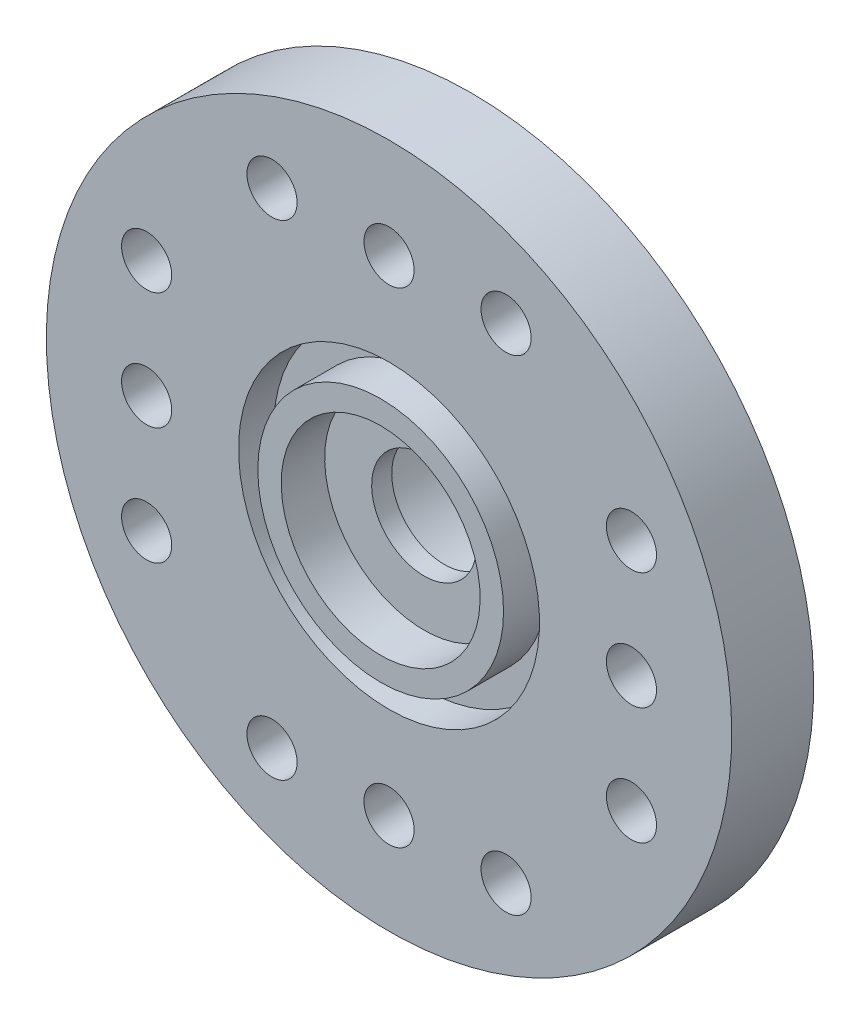
ISO-10303-21;
HEADER;
FILE_DESCRIPTION(('STEP AP214'),'2;1');
FILE_NAME('part.step','',(''),(''),'','','');
FILE_SCHEMA(('AUTOMOTIVE_DESIGN { 1 0 10303 214 1 1 1 1 }'));
ENDSEC;
DATA;
#1=APPLICATION_CONTEXT('core data for automotive mechanical design processes');
#2=APPLICATION_PROTOCOL_DEFINITION('international standard','automotive_design',2000,#1);
#3=PRODUCT_CONTEXT('',#1,'mechanical');
#4=PRODUCT('Part','Part','',(#3));
#5=PRODUCT_RELATED_PRODUCT_CATEGORY('part','',(#4));
#6=PRODUCT_DEFINITION_FORMATION('','',#4);
#7=PRODUCT_DEFINITION_CONTEXT('part definition',#1,'design');
#8=PRODUCT_DEFINITION('design','',#6,#7);
#9=PRODUCT_DEFINITION_SHAPE('','',#8);
#10=(LENGTH_UNIT() NAMED_UNIT(*) SI_UNIT(.MILLI.,.METRE.));
#11=(NAMED_UNIT(*) PLANE_ANGLE_UNIT() SI_UNIT($,.RADIAN.));
#12=(NAMED_UNIT(*) SI_UNIT($,.STERADIAN.) SOLID_ANGLE_UNIT());
#13=UNCERTAINTY_MEASURE_WITH_UNIT(LENGTH_MEASURE(1.E-05),#10,'distance_accuracy_value','');
#14=(GEOMETRIC_REPRESENTATION_CONTEXT(3) GLOBAL_UNCERTAINTY_ASSIGNED_CONTEXT((#13)) GLOBAL_UNIT_ASSIGNED_CONTEXT((#10,
#11,#12)) REPRESENTATION_CONTEXT('',''));
#15=CARTESIAN_POINT('',(0.,0.,0.));
#16=DIRECTION('',(0.,0.,1.));
#17=DIRECTION('',(1.,0.,0.));
#18=AXIS2_PLACEMENT_3D('',#15,#16,#17);
#19=CARTESIAN_POINT('',(2.975,0.,1.3));
#20=DIRECTION('',(0.,0.,1.));
#21=DIRECTION('',(1.,0.,0.));
#22=AXIS2_PLACEMENT_3D('',#19,#20,#21);
#23=PLANE('',#22);
#24=CARTESIAN_POINT('',(0.,0.,1.30000000001));
#25=DIRECTION('',(0.,0.,-1.));
#26=DIRECTION('',(0.,1.,0.));
#27=AXIS2_PLACEMENT_3D('',#24,#25,#26);
#28=CIRCLE('',#27,2.97500000001);
#29=CARTESIAN_POINT('',(0.,2.97500000001,1.30000000001));
#30=VERTEX_POINT('',#29);
#31=EDGE_CURVE('E249',#30,#30,#28,.T.);
#32=ORIENTED_EDGE('',*,*,#31,.T.);
#33=EDGE_LOOP('',(#32));
#34=FACE_BOUND('',#33,.T.);
#35=CARTESIAN_POINT('',(0.,0.,1.30000000001));
#36=DIRECTION('',(0.,0.,-1.));
#37=DIRECTION('',(0.,1.,0.));
#38=AXIS2_PLACEMENT_3D('',#35,#36,#37);
#39=CIRCLE('',#38,3.67500000001);
#40=CARTESIAN_POINT('',(0.,3.67500000001,1.30000000001));
#41=VERTEX_POINT('',#40);
#42=EDGE_CURVE('E248',#41,#41,#39,.T.);
#43=ORIENTED_EDGE('',*,*,#42,.F.);
#44=EDGE_LOOP('',(#43));
#45=FACE_BOUND('',#44,.T.);
#46=ADVANCED_FACE('F16',(#34,#45),#23,.T.);
#47=CARTESIAN_POINT('',(3.675,0.,0.));
#48=DIRECTION('',(0.,0.,1.));
#49=DIRECTION('',(1.,0.,0.));
#50=AXIS2_PLACEMENT_3D('',#47,#48,#49);
#51=PLANE('',#50);
#52=CARTESIAN_POINT('',(0.,0.,0.));
#53=DIRECTION('',(0.,0.,-1.));
#54=DIRECTION('',(0.,1.,0.));
#55=AXIS2_PLACEMENT_3D('',#52,#53,#54);
#56=CIRCLE('',#55,3.67500000001);
#57=CARTESIAN_POINT('',(0.,3.67500000001,0.));
#58=VERTEX_POINT('',#57);
#59=EDGE_CURVE('E245',#58,#58,#56,.T.);
#60=ORIENTED_EDGE('',*,*,#59,.T.);
#61=EDGE_LOOP('',(#60));
#62=FACE_BOUND('',#61,.T.);
#63=CARTESIAN_POINT('',(0.,0.,0.));
#64=DIRECTION('',(0.,0.,-1.));
#65=DIRECTION('',(0.,1.,0.));
#66=AXIS2_PLACEMENT_3D('',#63,#64,#65);
#67=CIRCLE('',#66,4.50000000001);
#68=CARTESIAN_POINT('',(0.,4.50000000001,0.));
#69=VERTEX_POINT('',#68);
#70=EDGE_CURVE('E262',#69,#69,#67,.T.);
#71=ORIENTED_EDGE('',*,*,#70,.F.);
#72=EDGE_LOOP('',(#71));
#73=FACE_BOUND('',#72,.T.);
#74=ADVANCED_FACE('F356',(#62,#73),#51,.T.);
#75=CARTESIAN_POINT('',(2.85,0.,-4.4));
#76=DIRECTION('',(0.,0.,-1.));
#77=DIRECTION('',(0.,-1.,0.));
#78=AXIS2_PLACEMENT_3D('',#75,#76,#77);
#79=PLANE('',#78);
#80=CARTESIAN_POINT('',(0.,0.,-4.40000000001));
#81=DIRECTION('',(0.,0.,-1.));
#82=DIRECTION('',(0.,1.,0.));
#83=AXIS2_PLACEMENT_3D('',#80,#81,#82);
#84=CIRCLE('',#83,2.85000000001);
#85=CARTESIAN_POINT('',(0.,2.85000000001,-4.40000000001));
#86=VERTEX_POINT('',#85);
#87=EDGE_CURVE('E238',#86,#86,#84,.T.);
#88=ORIENTED_EDGE('',*,*,#87,.F.);
#89=EDGE_LOOP('',(#88));
#90=FACE_BOUND('',#89,.T.);
#91=CARTESIAN_POINT('',(0.,0.,-4.40000000001));
#92=DIRECTION('',(0.,0.,-1.));
#93=DIRECTION('',(0.,1.,0.));
#94=AXIS2_PLACEMENT_3D('',#91,#92,#93);
#95=CIRCLE('',#94,4.20000000001);
#96=CARTESIAN_POINT('',(0.,4.20000000001,-4.40000000001));
#97=VERTEX_POINT('',#96);
#98=EDGE_CURVE('E213',#97,#97,#95,.T.);
#99=ORIENTED_EDGE('',*,*,#98,.T.);
#100=EDGE_LOOP('',(#99));
#101=FACE_BOUND('',#100,.T.);
#102=ADVANCED_FACE('F362',(#90,#101),#79,.T.);
#103=CARTESIAN_POINT('',(1.57,0.,-0.6));
#104=DIRECTION('',(0.,0.,-1.));
#105=DIRECTION('',(0.,-1.,0.));
#106=AXIS2_PLACEMENT_3D('',#103,#104,#105);
#107=PLANE('',#106);
#108=CARTESIAN_POINT('',(0.,0.,-0.60000000001));
#109=DIRECTION('',(0.,0.,-1.));
#110=DIRECTION('',(0.,1.,0.));
#111=AXIS2_PLACEMENT_3D('',#108,#109,#110);
#112=CIRCLE('',#111,1.57000000001);
#113=CARTESIAN_POINT('',(0.,1.57000000001,-0.60000000001));
#114=VERTEX_POINT('',#113);
#115=EDGE_CURVE('E27',#114,#114,#112,.T.);
#116=ORIENTED_EDGE('',*,*,#115,.F.);
#117=EDGE_LOOP('',(#116));
#118=FACE_BOUND('',#117,.T.);
#119=CARTESIAN_POINT('',(0.,0.,-0.60000000001));
#120=DIRECTION('',(0.,0.,-1.));
#121=DIRECTION('',(0.,1.,0.));
#122=AXIS2_PLACEMENT_3D('',#119,#120,#121);
#123=CIRCLE('',#122,2.85000000001);
#124=CARTESIAN_POINT('',(0.,2.85000000001,-0.60000000001));
#125=VERTEX_POINT('',#124);
#126=EDGE_CURVE('E234',#125,#125,#123,.T.);
#127=ORIENTED_EDGE('',*,*,#126,.T.);
#128=EDGE_LOOP('',(#127));
#129=FACE_BOUND('',#128,.T.);
#130=ADVANCED_FACE('F386',(#118,#129),#107,.T.);
#131=CARTESIAN_POINT('',(1.57,0.,0.));
#132=DIRECTION('',(0.,0.,1.));
#133=DIRECTION('',(1.,0.,0.));
#134=AXIS2_PLACEMENT_3D('',#131,#132,#133);
#135=PLANE('',#134);
#136=CARTESIAN_POINT('',(0.,0.,0.));
#137=DIRECTION('',(0.,0.,-1.));
#138=DIRECTION('',(0.,1.,0.));
#139=AXIS2_PLACEMENT_3D('',#136,#137,#138);
#140=CIRCLE('',#139,1.57000000001);
#141=CARTESIAN_POINT('',(0.,1.57000000001,0.));
#142=VERTEX_POINT('',#141);
#143=EDGE_CURVE('E11',#142,#142,#140,.T.);
#144=ORIENTED_EDGE('',*,*,#143,.T.);
#145=EDGE_LOOP('',(#144));
#146=FACE_BOUND('',#145,.T.);
#147=CARTESIAN_POINT('',(0.,0.,0.));
#148=DIRECTION('',(0.,0.,-1.));
#149=DIRECTION('',(0.,1.,0.));
#150=AXIS2_PLACEMENT_3D('',#147,#148,#149);
#151=CIRCLE('',#150,2.97500000001);
#152=CARTESIAN_POINT('',(0.,2.97500000001,0.));
#153=VERTEX_POINT('',#152);
#154=EDGE_CURVE('E297',#153,#153,#151,.T.);
#155=ORIENTED_EDGE('',*,*,#154,.F.);
#156=EDGE_LOOP('',(#155));
#157=FACE_BOUND('',#156,.T.);
#158=ADVANCED_FACE('F383',(#146,#157),#135,.T.);
#159=CARTESIAN_POINT('',(10.25,0.,1.05));
#160=DIRECTION('',(0.,0.,1.));
#161=DIRECTION('',(1.,0.,0.));
#162=AXIS2_PLACEMENT_3D('',#159,#160,#161);
#163=PLANE('',#162);
#164=CARTESIAN_POINT('',(-3.50000000000992,7.25000000001004,1.05000000001));
#165=DIRECTION('',(0.,0.,-1.));
#166=DIRECTION('',(-1.,1.33437416740113E-11,0.));
#167=AXIS2_PLACEMENT_3D('',#164,#165,#166);
#168=CIRCLE('',#167,0.75000000001);
#169=CARTESIAN_POINT('',(-4.25000000001993,7.25000000002005,1.05000000001));
#170=VERTEX_POINT('',#169);
#171=EDGE_CURVE('E222',#170,#170,#168,.T.);
#172=ORIENTED_EDGE('',*,*,#171,.T.);
#173=EDGE_LOOP('',(#172));
#174=FACE_BOUND('',#173,.T.);
#175=CARTESIAN_POINT('',(3.50000000000998,-7.25000000001001,1.05000000001));
#176=DIRECTION('',(0.,0.,-1.));
#177=DIRECTION('',(1.,-1.33368027801075E-11,0.));
#178=AXIS2_PLACEMENT_3D('',#175,#176,#177);
#179=CIRCLE('',#178,0.750000000009999);
#180=CARTESIAN_POINT('',(4.25000000001997,-7.25000000002001,1.05000000001));
#181=VERTEX_POINT('',#180);
#182=EDGE_CURVE('E199',#181,#181,#179,.T.);
#183=ORIENTED_EDGE('',*,*,#182,.T.);
#184=EDGE_LOOP('',(#183));
#185=FACE_BOUND('',#184,.T.);
#186=CARTESIAN_POINT('',(1.00759397191198E-11,7.25000000001,1.05000000001));
#187=DIRECTION('',(0.,0.,1.));
#188=DIRECTION('',(1.,-1.33437416740113E-11,0.));
#189=AXIS2_PLACEMENT_3D('',#186,#187,#188);
#190=CIRCLE('',#189,0.750000000009999);
#191=CARTESIAN_POINT('',(0.750000000020075,7.25,1.05000000001));
#192=VERTEX_POINT('',#191);
#193=EDGE_CURVE('E198',#192,#192,#190,.T.);
#194=ORIENTED_EDGE('',*,*,#193,.F.);
#195=EDGE_LOOP('',(#194));
#196=FACE_BOUND('',#195,.T.);
#197=CARTESIAN_POINT('',(-7.25000000001,0.,1.05000000001));
#198=DIRECTION('',(0.,0.,1.));
#199=DIRECTION('',(0.,1.,0.));
#200=AXIS2_PLACEMENT_3D('',#197,#198,#199);
#201=CIRCLE('',#200,0.750000000009999);
#202=CARTESIAN_POINT('',(-7.25000000001,0.750000000009999,1.05000000001));
#203=VERTEX_POINT('',#202);
#204=EDGE_CURVE('E231',#203,#203,#201,.T.);
#205=ORIENTED_EDGE('',*,*,#204,.F.);
#206=EDGE_LOOP('',(#205));
#207=FACE_BOUND('',#206,.T.);
#208=CARTESIAN_POINT('',(-1.00253132397066E-11,-7.25000000001,1.05000000001));
#209=DIRECTION('',(0.,0.,1.));
#210=DIRECTION('',(-1.,1.33368027801075E-11,0.));
#211=AXIS2_PLACEMENT_3D('',#208,#209,#210);
#212=CIRCLE('',#211,0.750000000009999);
#213=CARTESIAN_POINT('',(-0.750000000020024,-7.25,1.05000000001));
#214=VERTEX_POINT('',#213);
#215=EDGE_CURVE('E273',#214,#214,#212,.T.);
#216=ORIENTED_EDGE('',*,*,#215,.F.);
#217=EDGE_LOOP('',(#216));
#218=FACE_BOUND('',#217,.T.);
#219=CARTESIAN_POINT('',(0.,0.,1.05000000001));
#220=DIRECTION('',(0.,0.,-1.));
#221=DIRECTION('',(0.,1.,0.));
#222=AXIS2_PLACEMENT_3D('',#219,#220,#221);
#223=CIRCLE('',#222,4.50000000001);
#224=CARTESIAN_POINT('',(0.,4.50000000001,1.05000000001));
#225=VERTEX_POINT('',#224);
#226=EDGE_CURVE('E258',#225,#225,#223,.T.);
#227=ORIENTED_EDGE('',*,*,#226,.T.);
#228=EDGE_LOOP('',(#227));
#229=FACE_BOUND('',#228,.T.);
#230=CARTESIAN_POINT('',(7.25000000001,0.,1.05000000001));
#231=DIRECTION('',(0.,0.,1.));
#232=DIRECTION('',(0.,-1.,0.));
#233=AXIS2_PLACEMENT_3D('',#230,#231,#232);
#234=CIRCLE('',#233,0.750000000009999);
#235=CARTESIAN_POINT('',(7.25000000001,-0.750000000009999,1.05000000001));
#236=VERTEX_POINT('',#235);
#237=EDGE_CURVE('E241',#236,#236,#234,.T.);
#238=ORIENTED_EDGE('',*,*,#237,.F.);
#239=EDGE_LOOP('',(#238));
#240=FACE_BOUND('',#239,.T.);
#241=CARTESIAN_POINT('',(7.25000000001,-3.50000000001,1.05000000001));
#242=DIRECTION('',(0.,0.,1.));
#243=DIRECTION('',(0.,-1.,0.));
#244=AXIS2_PLACEMENT_3D('',#241,#242,#243);
#245=CIRCLE('',#244,0.750000000009999);
#246=CARTESIAN_POINT('',(7.25000000001,-4.25000000002,1.05000000001));
#247=VERTEX_POINT('',#246);
#248=EDGE_CURVE('E268',#247,#247,#245,.T.);
#249=ORIENTED_EDGE('',*,*,#248,.F.);
#250=EDGE_LOOP('',(#249));
#251=FACE_BOUND('',#250,.T.);
#252=CARTESIAN_POINT('',(7.25000000001,3.50000000001,1.05000000001));
#253=DIRECTION('',(0.,0.,-1.));
#254=DIRECTION('',(0.,1.,0.));
#255=AXIS2_PLACEMENT_3D('',#252,#253,#254);
#256=CIRCLE('',#255,0.750000000009999);
#257=CARTESIAN_POINT('',(7.25000000001,4.25000000002,1.05000000001));
#258=VERTEX_POINT('',#257);
#259=EDGE_CURVE('E250',#258,#258,#256,.T.);
#260=ORIENTED_EDGE('',*,*,#259,.T.);
#261=EDGE_LOOP('',(#260));
#262=FACE_BOUND('',#261,.T.);
#263=CARTESIAN_POINT('',(-7.25000000001,-3.50000000001,1.05000000001));
#264=DIRECTION('',(0.,0.,-1.));
#265=DIRECTION('',(0.,-1.,0.));
#266=AXIS2_PLACEMENT_3D('',#263,#264,#265);
#267=CIRCLE('',#266,0.750000000009999);
#268=CARTESIAN_POINT('',(-7.25000000001,-4.25000000002,1.05000000001));
#269=VERTEX_POINT('',#268);
#270=EDGE_CURVE('E89',#269,#269,#267,.T.);
#271=ORIENTED_EDGE('',*,*,#270,.T.);
#272=EDGE_LOOP('',(#271));
#273=FACE_BOUND('',#272,.T.);
#274=CARTESIAN_POINT('',(-3.50000000001003,-7.25000000000999,1.05000000001));
#275=DIRECTION('',(0.,0.,1.));
#276=DIRECTION('',(-1.,1.33368027801075E-11,0.));
#277=AXIS2_PLACEMENT_3D('',#274,#275,#276);
#278=CIRCLE('',#277,0.750000000009999);
#279=CARTESIAN_POINT('',(-4.25000000002002,-7.25,1.05000000001));
#280=VERTEX_POINT('',#279);
#281=EDGE_CURVE('E223',#280,#280,#278,.T.);
#282=ORIENTED_EDGE('',*,*,#281,.F.);
#283=EDGE_LOOP('',(#282));
#284=FACE_BOUND('',#283,.T.);
#285=CARTESIAN_POINT('',(-7.25000000001,3.50000000001,1.05000000001));
#286=DIRECTION('',(0.,0.,1.));
#287=DIRECTION('',(0.,1.,0.));
#288=AXIS2_PLACEMENT_3D('',#285,#286,#287);
#289=CIRCLE('',#288,0.750000000009999);
#290=CARTESIAN_POINT('',(-7.25000000001,4.25000000002,1.05000000001));
#291=VERTEX_POINT('',#290);
#292=EDGE_CURVE('E128',#291,#291,#289,.T.);
#293=ORIENTED_EDGE('',*,*,#292,.F.);
#294=EDGE_LOOP('',(#293));
#295=FACE_BOUND('',#294,.T.);
#296=CARTESIAN_POINT('',(3.50000000001007,7.25000000000996,1.05000000001));
#297=DIRECTION('',(0.,0.,1.));
#298=DIRECTION('',(1.,-1.33437416740113E-11,0.));
#299=AXIS2_PLACEMENT_3D('',#296,#297,#298);
#300=CIRCLE('',#299,0.750000000009999);
#301=CARTESIAN_POINT('',(4.25000000002007,7.25,1.05000000001));
#302=VERTEX_POINT('',#301);
#303=EDGE_CURVE('E271',#302,#302,#300,.T.);
#304=ORIENTED_EDGE('',*,*,#303,.F.);
#305=EDGE_LOOP('',(#304));
#306=FACE_BOUND('',#305,.T.);
#307=CARTESIAN_POINT('',(0.,0.,1.05000000001));
#308=DIRECTION('',(0.,0.,-1.));
#309=DIRECTION('',(0.,1.,0.));
#310=AXIS2_PLACEMENT_3D('',#307,#308,#309);
#311=CIRCLE('',#310,10.25000000001);
#312=CARTESIAN_POINT('',(0.,10.25000000001,1.05000000001));
#313=VERTEX_POINT('',#312);
#314=EDGE_CURVE('E218',#313,#313,#311,.T.);
#315=ORIENTED_EDGE('',*,*,#314,.F.);
#316=EDGE_LOOP('',(#315));
#317=FACE_BOUND('',#316,.T.);
#318=ADVANCED_FACE('F321',(#174,#185,#196,#207,#218,#229,#240,#251,#262,#273,#284,#295,#306,
#317),#163,.T.);
#319=CARTESIAN_POINT('',(4.2,0.,-1.4));
#320=DIRECTION('',(0.,0.,-1.));
#321=DIRECTION('',(0.,-1.,0.));
#322=AXIS2_PLACEMENT_3D('',#319,#320,#321);
#323=PLANE('',#322);
#324=CARTESIAN_POINT('',(-3.50000000000992,7.25000000001004,-1.40000000001));
#325=DIRECTION('',(0.,0.,1.));
#326=DIRECTION('',(0.,1.,0.));
#327=AXIS2_PLACEMENT_3D('',#324,#325,#326);
#328=CIRCLE('',#327,0.75000000001);
#329=CARTESIAN_POINT('',(-3.50000000000992,8.00000000002004,-1.40000000001));
#330=VERTEX_POINT('',#329);
#331=EDGE_CURVE('E228',#330,#330,#328,.T.);
#332=ORIENTED_EDGE('',*,*,#331,.T.);
#333=EDGE_LOOP('',(#332));
#334=FACE_BOUND('',#333,.T.);
#335=CARTESIAN_POINT('',(3.50000000000998,-7.25000000001001,-1.40000000001));
#336=DIRECTION('',(0.,0.,1.));
#337=DIRECTION('',(0.,1.,0.));
#338=AXIS2_PLACEMENT_3D('',#335,#336,#337);
#339=CIRCLE('',#338,0.75000000001);
#340=CARTESIAN_POINT('',(3.50000000000998,-6.5,-1.40000000001));
#341=VERTEX_POINT('',#340);
#342=EDGE_CURVE('E193',#341,#341,#339,.T.);
#343=ORIENTED_EDGE('',*,*,#342,.T.);
#344=EDGE_LOOP('',(#343));
#345=FACE_BOUND('',#344,.T.);
#346=CARTESIAN_POINT('',(1.00759397191198E-11,7.25000000001,-1.40000000001));
#347=DIRECTION('',(0.,0.,-1.));
#348=DIRECTION('',(0.,1.,0.));
#349=AXIS2_PLACEMENT_3D('',#346,#347,#348);
#350=CIRCLE('',#349,0.75000000001);
#351=CARTESIAN_POINT('',(1.00759397191198E-11,8.00000000002,-1.40000000001));
#352=VERTEX_POINT('',#351);
#353=EDGE_CURVE('E206',#352,#352,#350,.T.);
#354=ORIENTED_EDGE('',*,*,#353,.F.);
#355=EDGE_LOOP('',(#354));
#356=FACE_BOUND('',#355,.T.);
#357=CARTESIAN_POINT('',(-7.25000000001,0.,-1.40000000001));
#358=DIRECTION('',(0.,0.,-1.));
#359=DIRECTION('',(0.,1.,0.));
#360=AXIS2_PLACEMENT_3D('',#357,#358,#359);
#361=CIRCLE('',#360,0.750000000009999);
#362=CARTESIAN_POINT('',(-7.25000000001,0.750000000009999,-1.40000000001));
#363=VERTEX_POINT('',#362);
#364=EDGE_CURVE('E261',#363,#363,#361,.T.);
#365=ORIENTED_EDGE('',*,*,#364,.F.);
#366=EDGE_LOOP('',(#365));
#367=FACE_BOUND('',#366,.T.);
#368=CARTESIAN_POINT('',(-1.00253132397066E-11,-7.25000000001,-1.40000000001));
#369=DIRECTION('',(0.,0.,-1.));
#370=DIRECTION('',(0.,1.,0.));
#371=AXIS2_PLACEMENT_3D('',#368,#369,#370);
#372=CIRCLE('',#371,0.75000000001);
#373=CARTESIAN_POINT('',(-1.00253132397066E-11,-6.5,-1.40000000001));
#374=VERTEX_POINT('',#373);
#375=EDGE_CURVE('E254',#374,#374,#372,.T.);
#376=ORIENTED_EDGE('',*,*,#375,.F.);
#377=EDGE_LOOP('',(#376));
#378=FACE_BOUND('',#377,.T.);
#379=CARTESIAN_POINT('',(0.,0.,-1.40000000001));
#380=DIRECTION('',(0.,0.,-1.));
#381=DIRECTION('',(0.,1.,0.));
#382=AXIS2_PLACEMENT_3D('',#379,#380,#381);
#383=CIRCLE('',#382,4.20000000001);
#384=CARTESIAN_POINT('',(0.,4.20000000001,-1.40000000001));
#385=VERTEX_POINT('',#384);
#386=EDGE_CURVE('E217',#385,#385,#383,.T.);
#387=ORIENTED_EDGE('',*,*,#386,.F.);
#388=EDGE_LOOP('',(#387));
#389=FACE_BOUND('',#388,.T.);
#390=CARTESIAN_POINT('',(7.25000000001,0.,-1.40000000001));
#391=DIRECTION('',(0.,0.,-1.));
#392=DIRECTION('',(0.,1.,0.));
#393=AXIS2_PLACEMENT_3D('',#390,#391,#392);
#394=CIRCLE('',#393,0.750000000009999);
#395=CARTESIAN_POINT('',(7.25000000001,0.750000000009999,-1.40000000001));
#396=VERTEX_POINT('',#395);
#397=EDGE_CURVE('E244',#396,#396,#394,.T.);
#398=ORIENTED_EDGE('',*,*,#397,.F.);
#399=EDGE_LOOP('',(#398));
#400=FACE_BOUND('',#399,.T.);
#401=CARTESIAN_POINT('',(7.25000000001,-3.50000000001,-1.40000000001));
#402=DIRECTION('',(0.,0.,-1.));
#403=DIRECTION('',(0.,1.,0.));
#404=AXIS2_PLACEMENT_3D('',#401,#402,#403);
#405=CIRCLE('',#404,0.750000000009999);
#406=CARTESIAN_POINT('',(7.25000000001,-2.75,-1.40000000001));
#407=VERTEX_POINT('',#406);
#408=EDGE_CURVE('E211',#407,#407,#405,.T.);
#409=ORIENTED_EDGE('',*,*,#408,.F.);
#410=EDGE_LOOP('',(#409));
#411=FACE_BOUND('',#410,.T.);
#412=CARTESIAN_POINT('',(7.25000000001,3.50000000001,-1.40000000001));
#413=DIRECTION('',(0.,0.,1.));
#414=DIRECTION('',(0.,1.,0.));
#415=AXIS2_PLACEMENT_3D('',#412,#413,#414);
#416=CIRCLE('',#415,0.750000000009999);
#417=CARTESIAN_POINT('',(7.25000000001,4.25000000002,-1.40000000001));
#418=VERTEX_POINT('',#417);
#419=EDGE_CURVE('E253',#418,#418,#416,.T.);
#420=ORIENTED_EDGE('',*,*,#419,.T.);
#421=EDGE_LOOP('',(#420));
#422=FACE_BOUND('',#421,.T.);
#423=CARTESIAN_POINT('',(-7.25000000001,-3.50000000001,-1.40000000001));
#424=DIRECTION('',(0.,0.,1.));
#425=DIRECTION('',(0.,1.,0.));
#426=AXIS2_PLACEMENT_3D('',#423,#424,#425);
#427=CIRCLE('',#426,0.750000000009999);
#428=CARTESIAN_POINT('',(-7.25000000001,-2.75,-1.40000000001));
#429=VERTEX_POINT('',#428);
#430=EDGE_CURVE('E75',#429,#429,#427,.T.);
#431=ORIENTED_EDGE('',*,*,#430,.T.);
#432=EDGE_LOOP('',(#431));
#433=FACE_BOUND('',#432,.T.);
#434=CARTESIAN_POINT('',(-3.50000000001003,-7.25000000000999,-1.40000000001));
#435=DIRECTION('',(0.,0.,-1.));
#436=DIRECTION('',(0.,1.,0.));
#437=AXIS2_PLACEMENT_3D('',#434,#435,#436);
#438=CIRCLE('',#437,0.75000000001);
#439=CARTESIAN_POINT('',(-3.50000000001003,-6.5,-1.40000000001));
#440=VERTEX_POINT('',#439);
#441=EDGE_CURVE('E219',#440,#440,#438,.T.);
#442=ORIENTED_EDGE('',*,*,#441,.F.);
#443=EDGE_LOOP('',(#442));
#444=FACE_BOUND('',#443,.T.);
#445=CARTESIAN_POINT('',(-7.25000000001,3.50000000001,-1.40000000001));
#446=DIRECTION('',(0.,0.,-1.));
#447=DIRECTION('',(0.,1.,0.));
#448=AXIS2_PLACEMENT_3D('',#445,#446,#447);
#449=CIRCLE('',#448,0.750000000009999);
#450=CARTESIAN_POINT('',(-7.25000000001,4.25000000002,-1.40000000001));
#451=VERTEX_POINT('',#450);
#452=EDGE_CURVE('E116',#451,#451,#449,.T.);
#453=ORIENTED_EDGE('',*,*,#452,.F.);
#454=EDGE_LOOP('',(#453));
#455=FACE_BOUND('',#454,.T.);
#456=CARTESIAN_POINT('',(3.50000000001007,7.25000000000996,-1.40000000001));
#457=DIRECTION('',(0.,0.,-1.));
#458=DIRECTION('',(0.,1.,0.));
#459=AXIS2_PLACEMENT_3D('',#456,#457,#458);
#460=CIRCLE('',#459,0.75000000001);
#461=CARTESIAN_POINT('',(3.50000000001007,8.00000000001996,-1.40000000001));
#462=VERTEX_POINT('',#461);
#463=EDGE_CURVE('E20',#462,#462,#460,.T.);
#464=ORIENTED_EDGE('',*,*,#463,.F.);
#465=EDGE_LOOP('',(#464));
#466=FACE_BOUND('',#465,.T.);
#467=CARTESIAN_POINT('',(0.,0.,-1.40000000001));
#468=DIRECTION('',(0.,0.,-1.));
#469=DIRECTION('',(0.,1.,0.));
#470=AXIS2_PLACEMENT_3D('',#467,#468,#469);
#471=CIRCLE('',#470,10.25000000001);
#472=CARTESIAN_POINT('',(0.,10.25000000001,-1.40000000001));
#473=VERTEX_POINT('',#472);
#474=EDGE_CURVE('E255',#473,#473,#471,.T.);
#475=ORIENTED_EDGE('',*,*,#474,.T.);
#476=EDGE_LOOP('',(#475));
#477=FACE_BOUND('',#476,.T.);
#478=ADVANCED_FACE('F194',(#334,#345,#356,#367,#378,#389,#400,#411,#422,#433,#444,#455,#466,
#477),#323,.T.);
#479=CARTESIAN_POINT('',(0.,0.,0.));
#480=DIRECTION('',(0.,0.,-1.));
#481=DIRECTION('',(0.,1.,0.));
#482=AXIS2_PLACEMENT_3D('',#479,#480,#481);
#483=CYLINDRICAL_SURFACE('',#482,1.57);
#484=ORIENTED_EDGE('',*,*,#143,.F.);
#485=EDGE_LOOP('',(#484));
#486=FACE_BOUND('',#485,.T.);
#487=ORIENTED_EDGE('',*,*,#115,.T.);
#488=EDGE_LOOP('',(#487));
#489=FACE_BOUND('',#488,.T.);
#490=ADVANCED_FACE('F320',(#486,#489),#483,.F.);
#491=CARTESIAN_POINT('',(0.,0.,0.));
#492=DIRECTION('',(0.,0.,-1.));
#493=DIRECTION('',(0.,1.,0.));
#494=AXIS2_PLACEMENT_3D('',#491,#492,#493);
#495=CYLINDRICAL_SURFACE('',#494,2.85);
#496=ORIENTED_EDGE('',*,*,#126,.F.);
#497=EDGE_LOOP('',(#496));
#498=FACE_BOUND('',#497,.T.);
#499=ORIENTED_EDGE('',*,*,#87,.T.);
#500=EDGE_LOOP('',(#499));
#501=FACE_BOUND('',#500,.T.);
#502=ADVANCED_FACE('F349',(#498,#501),#495,.F.);
#503=CARTESIAN_POINT('',(0.,0.,0.));
#504=DIRECTION('',(0.,0.,-1.));
#505=DIRECTION('',(0.,1.,0.));
#506=AXIS2_PLACEMENT_3D('',#503,#504,#505);
#507=CYLINDRICAL_SURFACE('',#506,4.2);
#508=ORIENTED_EDGE('',*,*,#386,.T.);
#509=EDGE_LOOP('',(#508));
#510=FACE_BOUND('',#509,.T.);
#511=ORIENTED_EDGE('',*,*,#98,.F.);
#512=EDGE_LOOP('',(#511));
#513=FACE_BOUND('',#512,.T.);
#514=ADVANCED_FACE('F338',(#510,#513),#507,.T.);
#515=CARTESIAN_POINT('',(0.,0.,0.));
#516=DIRECTION('',(0.,0.,-1.));
#517=DIRECTION('',(0.,1.,0.));
#518=AXIS2_PLACEMENT_3D('',#515,#516,#517);
#519=CYLINDRICAL_SURFACE('',#518,10.25);
#520=ORIENTED_EDGE('',*,*,#314,.T.);
#521=EDGE_LOOP('',(#520));
#522=FACE_BOUND('',#521,.T.);
#523=ORIENTED_EDGE('',*,*,#474,.F.);
#524=EDGE_LOOP('',(#523));
#525=FACE_BOUND('',#524,.T.);
#526=ADVANCED_FACE('F335',(#522,#525),#519,.T.);
#527=CARTESIAN_POINT('',(0.,0.,0.));
#528=DIRECTION('',(0.,0.,-1.));
#529=DIRECTION('',(0.,1.,0.));
#530=AXIS2_PLACEMENT_3D('',#527,#528,#529);
#531=CYLINDRICAL_SURFACE('',#530,4.5);
#532=ORIENTED_EDGE('',*,*,#226,.F.);
#533=EDGE_LOOP('',(#532));
#534=FACE_BOUND('',#533,.T.);
#535=ORIENTED_EDGE('',*,*,#70,.T.);
#536=EDGE_LOOP('',(#535));
#537=FACE_BOUND('',#536,.T.);
#538=ADVANCED_FACE('F337',(#534,#537),#531,.F.);
#539=CARTESIAN_POINT('',(0.,0.,0.));
#540=DIRECTION('',(0.,0.,-1.));
#541=DIRECTION('',(0.,1.,0.));
#542=AXIS2_PLACEMENT_3D('',#539,#540,#541);
#543=CYLINDRICAL_SURFACE('',#542,3.675);
#544=ORIENTED_EDGE('',*,*,#42,.T.);
#545=EDGE_LOOP('',(#544));
#546=FACE_BOUND('',#545,.T.);
#547=ORIENTED_EDGE('',*,*,#59,.F.);
#548=EDGE_LOOP('',(#547));
#549=FACE_BOUND('',#548,.T.);
#550=ADVANCED_FACE('F346',(#546,#549),#543,.T.);
#551=CARTESIAN_POINT('',(0.,0.,0.));
#552=DIRECTION('',(0.,0.,-1.));
#553=DIRECTION('',(0.,1.,0.));
#554=AXIS2_PLACEMENT_3D('',#551,#552,#553);
#555=CYLINDRICAL_SURFACE('',#554,2.975);
#556=ORIENTED_EDGE('',*,*,#31,.F.);
#557=EDGE_LOOP('',(#556));
#558=FACE_BOUND('',#557,.T.);
#559=ORIENTED_EDGE('',*,*,#154,.T.);
#560=EDGE_LOOP('',(#559));
#561=FACE_BOUND('',#560,.T.);
#562=ADVANCED_FACE('F382',(#558,#561),#555,.F.);
#563=CARTESIAN_POINT('',(7.25,0.,-4.4));
#564=DIRECTION('',(0.,0.,1.));
#565=DIRECTION('',(0.,-1.,0.));
#566=AXIS2_PLACEMENT_3D('',#563,#564,#565);
#567=CYLINDRICAL_SURFACE('',#566,0.75);
#568=ORIENTED_EDGE('',*,*,#397,.T.);
#569=EDGE_LOOP('',(#568));
#570=FACE_BOUND('',#569,.T.);
#571=ORIENTED_EDGE('',*,*,#237,.T.);
#572=EDGE_LOOP('',(#571));
#573=FACE_BOUND('',#572,.T.);
#574=ADVANCED_FACE('F315',(#570,#573),#567,.F.);
#575=CARTESIAN_POINT('',(7.25,-3.5,-4.4));
#576=DIRECTION('',(0.,0.,1.));
#577=DIRECTION('',(0.,-1.,0.));
#578=AXIS2_PLACEMENT_3D('',#575,#576,#577);
#579=CYLINDRICAL_SURFACE('',#578,0.75);
#580=ORIENTED_EDGE('',*,*,#408,.T.);
#581=EDGE_LOOP('',(#580));
#582=FACE_BOUND('',#581,.T.);
#583=ORIENTED_EDGE('',*,*,#248,.T.);
#584=EDGE_LOOP('',(#583));
#585=FACE_BOUND('',#584,.T.);
#586=ADVANCED_FACE('F381',(#582,#585),#579,.F.);
#587=CARTESIAN_POINT('',(7.25,3.5,-4.4));
#588=DIRECTION('',(0.,0.,1.));
#589=DIRECTION('',(0.,-1.,0.));
#590=AXIS2_PLACEMENT_3D('',#587,#588,#589);
#591=CYLINDRICAL_SURFACE('',#590,0.75);
#592=ORIENTED_EDGE('',*,*,#419,.F.);
#593=EDGE_LOOP('',(#592));
#594=FACE_BOUND('',#593,.T.);
#595=ORIENTED_EDGE('',*,*,#259,.F.);
#596=EDGE_LOOP('',(#595));
#597=FACE_BOUND('',#596,.T.);
#598=ADVANCED_FACE('F367',(#594,#597),#591,.F.);
#599=CARTESIAN_POINT('',(0.,-7.25,-4.4));
#600=DIRECTION('',(0.,0.,1.));
#601=DIRECTION('',(0.,-1.,0.));
#602=AXIS2_PLACEMENT_3D('',#599,#600,#601);
#603=CYLINDRICAL_SURFACE('',#602,0.75);
#604=ORIENTED_EDGE('',*,*,#375,.T.);
#605=EDGE_LOOP('',(#604));
#606=FACE_BOUND('',#605,.T.);
#607=ORIENTED_EDGE('',*,*,#215,.T.);
#608=EDGE_LOOP('',(#607));
#609=FACE_BOUND('',#608,.T.);
#610=ADVANCED_FACE('F377',(#606,#609),#603,.F.);
#611=CARTESIAN_POINT('',(-7.25,0.,-4.4));
#612=DIRECTION('',(0.,0.,1.));
#613=DIRECTION('',(0.,-1.,0.));
#614=AXIS2_PLACEMENT_3D('',#611,#612,#613);
#615=CYLINDRICAL_SURFACE('',#614,0.75);
#616=ORIENTED_EDGE('',*,*,#364,.T.);
#617=EDGE_LOOP('',(#616));
#618=FACE_BOUND('',#617,.T.);
#619=ORIENTED_EDGE('',*,*,#204,.T.);
#620=EDGE_LOOP('',(#619));
#621=FACE_BOUND('',#620,.T.);
#622=ADVANCED_FACE('F374',(#618,#621),#615,.F.);
#623=CARTESIAN_POINT('',(0.,7.25,-4.4));
#624=DIRECTION('',(0.,0.,1.));
#625=DIRECTION('',(0.,-1.,0.));
#626=AXIS2_PLACEMENT_3D('',#623,#624,#625);
#627=CYLINDRICAL_SURFACE('',#626,0.75);
#628=ORIENTED_EDGE('',*,*,#353,.T.);
#629=EDGE_LOOP('',(#628));
#630=FACE_BOUND('',#629,.T.);
#631=ORIENTED_EDGE('',*,*,#193,.T.);
#632=EDGE_LOOP('',(#631));
#633=FACE_BOUND('',#632,.T.);
#634=ADVANCED_FACE('F376',(#630,#633),#627,.F.);
#635=CARTESIAN_POINT('',(3.5,-7.25,-4.4));
#636=DIRECTION('',(0.,0.,1.));
#637=DIRECTION('',(0.,-1.,0.));
#638=AXIS2_PLACEMENT_3D('',#635,#636,#637);
#639=CYLINDRICAL_SURFACE('',#638,0.75);
#640=ORIENTED_EDGE('',*,*,#342,.F.);
#641=EDGE_LOOP('',(#640));
#642=FACE_BOUND('',#641,.T.);
#643=ORIENTED_EDGE('',*,*,#182,.F.);
#644=EDGE_LOOP('',(#643));
#645=FACE_BOUND('',#644,.T.);
#646=ADVANCED_FACE('F408',(#642,#645),#639,.F.);
#647=CARTESIAN_POINT('',(-7.25,-3.5,-4.4));
#648=DIRECTION('',(0.,0.,1.));
#649=DIRECTION('',(0.,-1.,0.));
#650=AXIS2_PLACEMENT_3D('',#647,#648,#649);
#651=CYLINDRICAL_SURFACE('',#650,0.75);
#652=ORIENTED_EDGE('',*,*,#430,.F.);
#653=EDGE_LOOP('',(#652));
#654=FACE_BOUND('',#653,.T.);
#655=ORIENTED_EDGE('',*,*,#270,.F.);
#656=EDGE_LOOP('',(#655));
#657=FACE_BOUND('',#656,.T.);
#658=ADVANCED_FACE('F413',(#654,#657),#651,.F.);
#659=CARTESIAN_POINT('',(-3.49999999999993,7.25,-4.4));
#660=DIRECTION('',(0.,0.,1.));
#661=DIRECTION('',(0.,-1.,0.));
#662=AXIS2_PLACEMENT_3D('',#659,#660,#661);
#663=CYLINDRICAL_SURFACE('',#662,0.75);
#664=ORIENTED_EDGE('',*,*,#331,.F.);
#665=EDGE_LOOP('',(#664));
#666=FACE_BOUND('',#665,.T.);
#667=ORIENTED_EDGE('',*,*,#171,.F.);
#668=EDGE_LOOP('',(#667));
#669=FACE_BOUND('',#668,.T.);
#670=ADVANCED_FACE('F18',(#666,#669),#663,.F.);
#671=CARTESIAN_POINT('',(-3.5,-7.25,-4.4));
#672=DIRECTION('',(0.,0.,1.));
#673=DIRECTION('',(0.,-1.,0.));
#674=AXIS2_PLACEMENT_3D('',#671,#672,#673);
#675=CYLINDRICAL_SURFACE('',#674,0.75);
#676=ORIENTED_EDGE('',*,*,#441,.T.);
#677=EDGE_LOOP('',(#676));
#678=FACE_BOUND('',#677,.T.);
#679=ORIENTED_EDGE('',*,*,#281,.T.);
#680=EDGE_LOOP('',(#679));
#681=FACE_BOUND('',#680,.T.);
#682=ADVANCED_FACE('F369',(#678,#681),#675,.F.);
#683=CARTESIAN_POINT('',(-7.25,3.5,-4.4));
#684=DIRECTION('',(0.,0.,1.));
#685=DIRECTION('',(0.,-1.,0.));
#686=AXIS2_PLACEMENT_3D('',#683,#684,#685);
#687=CYLINDRICAL_SURFACE('',#686,0.75);
#688=ORIENTED_EDGE('',*,*,#452,.T.);
#689=EDGE_LOOP('',(#688));
#690=FACE_BOUND('',#689,.T.);
#691=ORIENTED_EDGE('',*,*,#292,.T.);
#692=EDGE_LOOP('',(#691));
#693=FACE_BOUND('',#692,.T.);
#694=ADVANCED_FACE('F372',(#690,#693),#687,.F.);
#695=CARTESIAN_POINT('',(3.50000000000008,7.25,-4.4));
#696=DIRECTION('',(0.,0.,1.));
#697=DIRECTION('',(0.,-1.,0.));
#698=AXIS2_PLACEMENT_3D('',#695,#696,#697);
#699=CYLINDRICAL_SURFACE('',#698,0.75);
#700=ORIENTED_EDGE('',*,*,#463,.T.);
#701=EDGE_LOOP('',(#700));
#702=FACE_BOUND('',#701,.T.);
#703=ORIENTED_EDGE('',*,*,#303,.T.);
#704=EDGE_LOOP('',(#703));
#705=FACE_BOUND('',#704,.T.);
#706=ADVANCED_FACE('F393',(#702,#705),#699,.F.);
#707=CLOSED_SHELL('',(#46,#74,#102,#130,#158,#318,#478,#490,#502,#514,#526,#538,#550,#562,#574,
#586,#598,#610,#622,#634,#646,#658,#670,#682,#694,#706));
#708=MANIFOLD_SOLID_BREP('B1',#707);
#709=ADVANCED_BREP_SHAPE_REPRESENTATION('',(#18,#708),#14);
#710=SHAPE_DEFINITION_REPRESENTATION(#9,#709);
ENDSEC;
END-ISO-10303-21;
